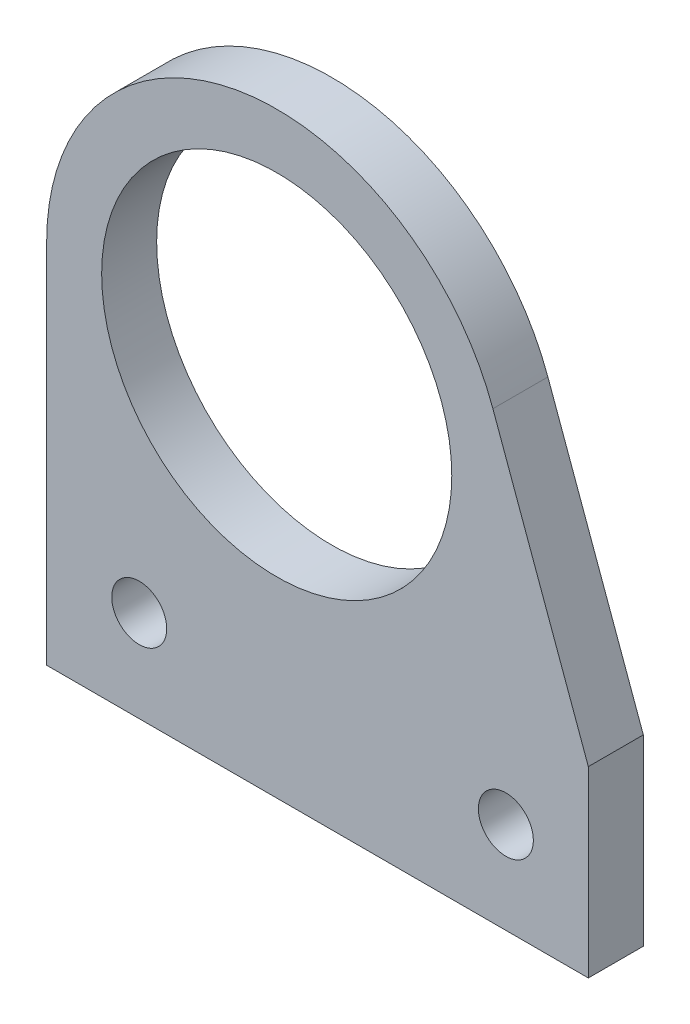
ISO-10303-21;
HEADER;
FILE_DESCRIPTION(('STEP AP214'),'2;1');
FILE_NAME('part.step','',(''),(''),'','','');
FILE_SCHEMA(('AUTOMOTIVE_DESIGN { 1 0 10303 214 1 1 1 1 }'));
ENDSEC;
DATA;
#1=APPLICATION_CONTEXT('core data for automotive mechanical design processes');
#2=APPLICATION_PROTOCOL_DEFINITION('international standard','automotive_design',2000,#1);
#3=PRODUCT_CONTEXT('',#1,'mechanical');
#4=PRODUCT('Part','Part','',(#3));
#5=PRODUCT_RELATED_PRODUCT_CATEGORY('part','',(#4));
#6=PRODUCT_DEFINITION_FORMATION('','',#4);
#7=PRODUCT_DEFINITION_CONTEXT('part definition',#1,'design');
#8=PRODUCT_DEFINITION('design','',#6,#7);
#9=PRODUCT_DEFINITION_SHAPE('','',#8);
#10=(LENGTH_UNIT() NAMED_UNIT(*) SI_UNIT(.MILLI.,.METRE.));
#11=(NAMED_UNIT(*) PLANE_ANGLE_UNIT() SI_UNIT($,.RADIAN.));
#12=(NAMED_UNIT(*) SI_UNIT($,.STERADIAN.) SOLID_ANGLE_UNIT());
#13=UNCERTAINTY_MEASURE_WITH_UNIT(LENGTH_MEASURE(1.E-05),#10,'distance_accuracy_value','');
#14=(GEOMETRIC_REPRESENTATION_CONTEXT(3) GLOBAL_UNCERTAINTY_ASSIGNED_CONTEXT((#13)) GLOBAL_UNIT_ASSIGNED_CONTEXT((#10,
#11,#12)) REPRESENTATION_CONTEXT('',''));
#15=CARTESIAN_POINT('',(0.,0.,0.));
#16=DIRECTION('',(0.,0.,1.));
#17=DIRECTION('',(1.,0.,0.));
#18=AXIS2_PLACEMENT_3D('',#15,#16,#17);
#19=CARTESIAN_POINT('',(0.,0.,3.));
#20=DIRECTION('',(0.,0.,1.));
#21=DIRECTION('',(1.,0.,0.));
#22=AXIS2_PLACEMENT_3D('',#19,#20,#21);
#23=PLANE('',#22);
#24=CARTESIAN_POINT('',(-7.5,-15.,3.));
#25=DIRECTION('',(0.,0.,1.));
#26=DIRECTION('',(1.,0.,0.));
#27=AXIS2_PLACEMENT_3D('',#24,#25,#26);
#28=CIRCLE('',#27,1.5);
#29=CARTESIAN_POINT('',(-6.,-15.,3.));
#30=VERTEX_POINT('',#29);
#31=EDGE_CURVE('E175',#30,#30,#28,.T.);
#32=ORIENTED_EDGE('',*,*,#31,.F.);
#33=EDGE_LOOP('',(#32));
#34=FACE_BOUND('',#33,.T.);
#35=DIRECTION('',(0.,-1.,0.));
#36=VECTOR('',#35,1.);
#37=CARTESIAN_POINT('',(-12.55,-20.,3.));
#38=LINE('',#37,#36);
#39=CARTESIAN_POINT('',(-12.55,0.,3.));
#40=VERTEX_POINT('',#39);
#41=CARTESIAN_POINT('',(-12.55,-20.,3.));
#42=VERTEX_POINT('',#41);
#43=EDGE_CURVE('E125',#40,#42,#38,.T.);
#44=ORIENTED_EDGE('',*,*,#43,.T.);
#45=DIRECTION('',(1.,0.,0.));
#46=VECTOR('',#45,1.);
#47=CARTESIAN_POINT('',(-12.55,-20.,3.));
#48=LINE('',#47,#46);
#49=CARTESIAN_POINT('',(17.,-20.,3.));
#50=VERTEX_POINT('',#49);
#51=EDGE_CURVE('E92',#42,#50,#48,.T.);
#52=ORIENTED_EDGE('',*,*,#51,.T.);
#53=DIRECTION('',(0.,1.,0.));
#54=VECTOR('',#53,1.);
#55=CARTESIAN_POINT('',(17.,-10.0133709086818,3.));
#56=LINE('',#55,#54);
#57=CARTESIAN_POINT('',(17.,-10.0133709086818,3.));
#58=VERTEX_POINT('',#57);
#59=EDGE_CURVE('E96',#50,#58,#56,.T.);
#60=ORIENTED_EDGE('',*,*,#59,.T.);
#61=DIRECTION('',(-0.34202014332567,0.939692620785908,0.));
#62=VECTOR('',#61,1.);
#63=CARTESIAN_POINT('',(11.7931423908631,4.29235279873716,3.));
#64=LINE('',#63,#62);
#65=CARTESIAN_POINT('',(11.7931423908631,4.29235279873716,3.));
#66=VERTEX_POINT('',#65);
#67=EDGE_CURVE('E100',#58,#66,#64,.T.);
#68=ORIENTED_EDGE('',*,*,#67,.T.);
#69=CARTESIAN_POINT('',(0.,0.,3.));
#70=DIRECTION('',(0.,0.,1.));
#71=DIRECTION('',(1.,0.,0.));
#72=AXIS2_PLACEMENT_3D('',#69,#70,#71);
#73=CIRCLE('',#72,12.55);
#74=EDGE_CURVE('E58',#66,#40,#73,.T.);
#75=ORIENTED_EDGE('',*,*,#74,.T.);
#76=EDGE_LOOP('',(#44,#52,#60,#68,#75));
#77=FACE_BOUND('',#76,.T.);
#78=CARTESIAN_POINT('',(0.,0.,3.));
#79=DIRECTION('',(0.,0.,1.));
#80=DIRECTION('',(1.,0.,0.));
#81=AXIS2_PLACEMENT_3D('',#78,#79,#80);
#82=CIRCLE('',#81,9.55);
#83=CARTESIAN_POINT('',(9.55000000000003,0.,3.));
#84=VERTEX_POINT('',#83);
#85=EDGE_CURVE('E120',#84,#84,#82,.T.);
#86=ORIENTED_EDGE('',*,*,#85,.F.);
#87=EDGE_LOOP('',(#86));
#88=FACE_BOUND('',#87,.T.);
#89=CARTESIAN_POINT('',(12.5,-15.,3.));
#90=DIRECTION('',(0.,0.,1.));
#91=DIRECTION('',(1.,0.,0.));
#92=AXIS2_PLACEMENT_3D('',#89,#90,#91);
#93=CIRCLE('',#92,1.5);
#94=CARTESIAN_POINT('',(14.,-15.,3.));
#95=VERTEX_POINT('',#94);
#96=EDGE_CURVE('E166',#95,#95,#93,.T.);
#97=ORIENTED_EDGE('',*,*,#96,.F.);
#98=EDGE_LOOP('',(#97));
#99=FACE_BOUND('',#98,.T.);
#100=ADVANCED_FACE('F41',(#34,#77,#88,#99),#23,.T.);
#101=CARTESIAN_POINT('',(0.,0.,0.));
#102=DIRECTION('',(0.,0.,1.));
#103=DIRECTION('',(1.,0.,0.));
#104=AXIS2_PLACEMENT_3D('',#101,#102,#103);
#105=PLANE('',#104);
#106=DIRECTION('',(0.,-1.,0.));
#107=VECTOR('',#106,1.);
#108=CARTESIAN_POINT('',(-12.55,-20.,0.));
#109=LINE('',#108,#107);
#110=CARTESIAN_POINT('',(-12.55,0.,0.));
#111=VERTEX_POINT('',#110);
#112=CARTESIAN_POINT('',(-12.55,-20.,0.));
#113=VERTEX_POINT('',#112);
#114=EDGE_CURVE('E116',#111,#113,#109,.T.);
#115=ORIENTED_EDGE('',*,*,#114,.F.);
#116=CARTESIAN_POINT('',(0.,0.,0.));
#117=DIRECTION('',(0.,0.,1.));
#118=DIRECTION('',(1.,0.,0.));
#119=AXIS2_PLACEMENT_3D('',#116,#117,#118);
#120=CIRCLE('',#119,12.55);
#121=CARTESIAN_POINT('',(11.7931423908631,4.29235279873716,0.));
#122=VERTEX_POINT('',#121);
#123=EDGE_CURVE('E84',#122,#111,#120,.T.);
#124=ORIENTED_EDGE('',*,*,#123,.F.);
#125=DIRECTION('',(-0.34202014332567,0.939692620785908,0.));
#126=VECTOR('',#125,1.);
#127=CARTESIAN_POINT('',(11.7931423908631,4.29235279873716,0.));
#128=LINE('',#127,#126);
#129=CARTESIAN_POINT('',(17.,-10.0133709086818,0.));
#130=VERTEX_POINT('',#129);
#131=EDGE_CURVE('E78',#130,#122,#128,.T.);
#132=ORIENTED_EDGE('',*,*,#131,.F.);
#133=DIRECTION('',(0.,1.,0.));
#134=VECTOR('',#133,1.);
#135=CARTESIAN_POINT('',(17.,-10.0133709086818,0.));
#136=LINE('',#135,#134);
#137=CARTESIAN_POINT('',(17.,-20.,0.));
#138=VERTEX_POINT('',#137);
#139=EDGE_CURVE('E107',#138,#130,#136,.T.);
#140=ORIENTED_EDGE('',*,*,#139,.F.);
#141=DIRECTION('',(1.,0.,0.));
#142=VECTOR('',#141,1.);
#143=CARTESIAN_POINT('',(-12.55,-20.,0.));
#144=LINE('',#143,#142);
#145=EDGE_CURVE('E119',#113,#138,#144,.T.);
#146=ORIENTED_EDGE('',*,*,#145,.F.);
#147=EDGE_LOOP('',(#115,#124,#132,#140,#146));
#148=FACE_BOUND('',#147,.T.);
#149=CARTESIAN_POINT('',(0.,0.,0.));
#150=DIRECTION('',(0.,0.,1.));
#151=DIRECTION('',(1.,0.,0.));
#152=AXIS2_PLACEMENT_3D('',#149,#150,#151);
#153=CIRCLE('',#152,9.55);
#154=CARTESIAN_POINT('',(9.55000000000003,0.,0.));
#155=VERTEX_POINT('',#154);
#156=EDGE_CURVE('E178',#155,#155,#153,.T.);
#157=ORIENTED_EDGE('',*,*,#156,.T.);
#158=EDGE_LOOP('',(#157));
#159=FACE_BOUND('',#158,.T.);
#160=CARTESIAN_POINT('',(-7.5,-15.,0.));
#161=DIRECTION('',(0.,0.,1.));
#162=DIRECTION('',(1.,0.,0.));
#163=AXIS2_PLACEMENT_3D('',#160,#161,#162);
#164=CIRCLE('',#163,1.5);
#165=CARTESIAN_POINT('',(-6.,-15.,0.));
#166=VERTEX_POINT('',#165);
#167=EDGE_CURVE('E172',#166,#166,#164,.T.);
#168=ORIENTED_EDGE('',*,*,#167,.T.);
#169=EDGE_LOOP('',(#168));
#170=FACE_BOUND('',#169,.T.);
#171=CARTESIAN_POINT('',(12.5,-15.,0.));
#172=DIRECTION('',(0.,0.,1.));
#173=DIRECTION('',(1.,0.,0.));
#174=AXIS2_PLACEMENT_3D('',#171,#172,#173);
#175=CIRCLE('',#174,1.5);
#176=CARTESIAN_POINT('',(14.,-15.,0.));
#177=VERTEX_POINT('',#176);
#178=EDGE_CURVE('E169',#177,#177,#175,.T.);
#179=ORIENTED_EDGE('',*,*,#178,.T.);
#180=EDGE_LOOP('',(#179));
#181=FACE_BOUND('',#180,.T.);
#182=ADVANCED_FACE('F129',(#148,#159,#170,#181),#105,.F.);
#183=CARTESIAN_POINT('',(-12.55,-20.,3.));
#184=DIRECTION('',(1.,0.,0.));
#185=DIRECTION('',(0.,1.,0.));
#186=AXIS2_PLACEMENT_3D('',#183,#184,#185);
#187=PLANE('',#186);
#188=ORIENTED_EDGE('',*,*,#114,.T.);
#189=DIRECTION('',(0.,0.,-1.));
#190=VECTOR('',#189,1.);
#191=CARTESIAN_POINT('',(-12.55,-20.,3.));
#192=LINE('',#191,#190);
#193=EDGE_CURVE('E11',#42,#113,#192,.T.);
#194=ORIENTED_EDGE('',*,*,#193,.F.);
#195=ORIENTED_EDGE('',*,*,#43,.F.);
#196=DIRECTION('',(0.,0.,-1.));
#197=VECTOR('',#196,1.);
#198=CARTESIAN_POINT('',(-12.55,0.,3.));
#199=LINE('',#198,#197);
#200=EDGE_CURVE('E112',#40,#111,#199,.T.);
#201=ORIENTED_EDGE('',*,*,#200,.T.);
#202=EDGE_LOOP('',(#188,#194,#195,#201));
#203=FACE_BOUND('',#202,.T.);
#204=ADVANCED_FACE('F43',(#203),#187,.F.);
#205=CARTESIAN_POINT('',(-12.55,-20.,3.));
#206=DIRECTION('',(0.,1.,0.));
#207=DIRECTION('',(0.,0.,1.));
#208=AXIS2_PLACEMENT_3D('',#205,#206,#207);
#209=PLANE('',#208);
#210=ORIENTED_EDGE('',*,*,#145,.T.);
#211=DIRECTION('',(0.,0.,-1.));
#212=VECTOR('',#211,1.);
#213=CARTESIAN_POINT('',(17.,-20.,3.));
#214=LINE('',#213,#212);
#215=EDGE_CURVE('E50',#50,#138,#214,.T.);
#216=ORIENTED_EDGE('',*,*,#215,.F.);
#217=ORIENTED_EDGE('',*,*,#51,.F.);
#218=ORIENTED_EDGE('',*,*,#193,.T.);
#219=EDGE_LOOP('',(#210,#216,#217,#218));
#220=FACE_BOUND('',#219,.T.);
#221=ADVANCED_FACE('F222',(#220),#209,.F.);
#222=CARTESIAN_POINT('',(17.,-10.0133709086818,3.));
#223=DIRECTION('',(-1.,0.,0.));
#224=DIRECTION('',(0.,-1.,0.));
#225=AXIS2_PLACEMENT_3D('',#222,#223,#224);
#226=PLANE('',#225);
#227=ORIENTED_EDGE('',*,*,#139,.T.);
#228=DIRECTION('',(0.,0.,-1.));
#229=VECTOR('',#228,1.);
#230=CARTESIAN_POINT('',(17.,-10.0133709086818,3.));
#231=LINE('',#230,#229);
#232=EDGE_CURVE('E104',#58,#130,#231,.T.);
#233=ORIENTED_EDGE('',*,*,#232,.F.);
#234=ORIENTED_EDGE('',*,*,#59,.F.);
#235=ORIENTED_EDGE('',*,*,#215,.T.);
#236=EDGE_LOOP('',(#227,#233,#234,#235));
#237=FACE_BOUND('',#236,.T.);
#238=ADVANCED_FACE('F105',(#237),#226,.F.);
#239=CARTESIAN_POINT('',(11.7931423908631,4.29235279873716,3.));
#240=DIRECTION('',(-0.939692620785908,-0.34202014332567,0.));
#241=DIRECTION('',(0.34202014332567,-0.939692620785908,0.));
#242=AXIS2_PLACEMENT_3D('',#239,#240,#241);
#243=PLANE('',#242);
#244=ORIENTED_EDGE('',*,*,#131,.T.);
#245=DIRECTION('',(0.,0.,-1.));
#246=VECTOR('',#245,1.);
#247=CARTESIAN_POINT('',(11.7931423908631,4.29235279873716,3.));
#248=LINE('',#247,#246);
#249=EDGE_CURVE('E108',#66,#122,#248,.T.);
#250=ORIENTED_EDGE('',*,*,#249,.F.);
#251=ORIENTED_EDGE('',*,*,#67,.F.);
#252=ORIENTED_EDGE('',*,*,#232,.T.);
#253=EDGE_LOOP('',(#244,#250,#251,#252));
#254=FACE_BOUND('',#253,.T.);
#255=ADVANCED_FACE('F110',(#254),#243,.F.);
#256=CARTESIAN_POINT('',(0.,0.,3.));
#257=DIRECTION('',(0.,0.,-1.));
#258=DIRECTION('',(-1.,0.,0.));
#259=AXIS2_PLACEMENT_3D('',#256,#257,#258);
#260=CYLINDRICAL_SURFACE('',#259,12.55);
#261=ORIENTED_EDGE('',*,*,#123,.T.);
#262=ORIENTED_EDGE('',*,*,#200,.F.);
#263=ORIENTED_EDGE('',*,*,#74,.F.);
#264=ORIENTED_EDGE('',*,*,#249,.T.);
#265=EDGE_LOOP('',(#261,#262,#263,#264));
#266=FACE_BOUND('',#265,.T.);
#267=ADVANCED_FACE('F134',(#266),#260,.T.);
#268=CARTESIAN_POINT('',(0.,0.,3.));
#269=DIRECTION('',(0.,0.,-1.));
#270=DIRECTION('',(-1.,0.,0.));
#271=AXIS2_PLACEMENT_3D('',#268,#269,#270);
#272=CYLINDRICAL_SURFACE('',#271,9.55);
#273=ORIENTED_EDGE('',*,*,#85,.T.);
#274=EDGE_LOOP('',(#273));
#275=FACE_BOUND('',#274,.T.);
#276=ORIENTED_EDGE('',*,*,#156,.F.);
#277=EDGE_LOOP('',(#276));
#278=FACE_BOUND('',#277,.T.);
#279=ADVANCED_FACE('F136',(#275,#278),#272,.F.);
#280=CARTESIAN_POINT('',(-7.5,-15.,3.));
#281=DIRECTION('',(0.,0.,-1.));
#282=DIRECTION('',(-1.,0.,0.));
#283=AXIS2_PLACEMENT_3D('',#280,#281,#282);
#284=CYLINDRICAL_SURFACE('',#283,1.5);
#285=ORIENTED_EDGE('',*,*,#31,.T.);
#286=EDGE_LOOP('',(#285));
#287=FACE_BOUND('',#286,.T.);
#288=ORIENTED_EDGE('',*,*,#167,.F.);
#289=EDGE_LOOP('',(#288));
#290=FACE_BOUND('',#289,.T.);
#291=ADVANCED_FACE('F142',(#287,#290),#284,.F.);
#292=CARTESIAN_POINT('',(12.5,-15.,3.));
#293=DIRECTION('',(0.,0.,-1.));
#294=DIRECTION('',(-1.,0.,0.));
#295=AXIS2_PLACEMENT_3D('',#292,#293,#294);
#296=CYLINDRICAL_SURFACE('',#295,1.5);
#297=ORIENTED_EDGE('',*,*,#96,.T.);
#298=EDGE_LOOP('',(#297));
#299=FACE_BOUND('',#298,.T.);
#300=ORIENTED_EDGE('',*,*,#178,.F.);
#301=EDGE_LOOP('',(#300));
#302=FACE_BOUND('',#301,.T.);
#303=ADVANCED_FACE('F157',(#299,#302),#296,.F.);
#304=CLOSED_SHELL('',(#100,#182,#204,#221,#238,#255,#267,#279,#291,#303));
#305=MANIFOLD_SOLID_BREP('B2',#304);
#306=ADVANCED_BREP_SHAPE_REPRESENTATION('',(#18,#305),#14);
#307=SHAPE_DEFINITION_REPRESENTATION(#9,#306);
ENDSEC;
END-ISO-10303-21;
